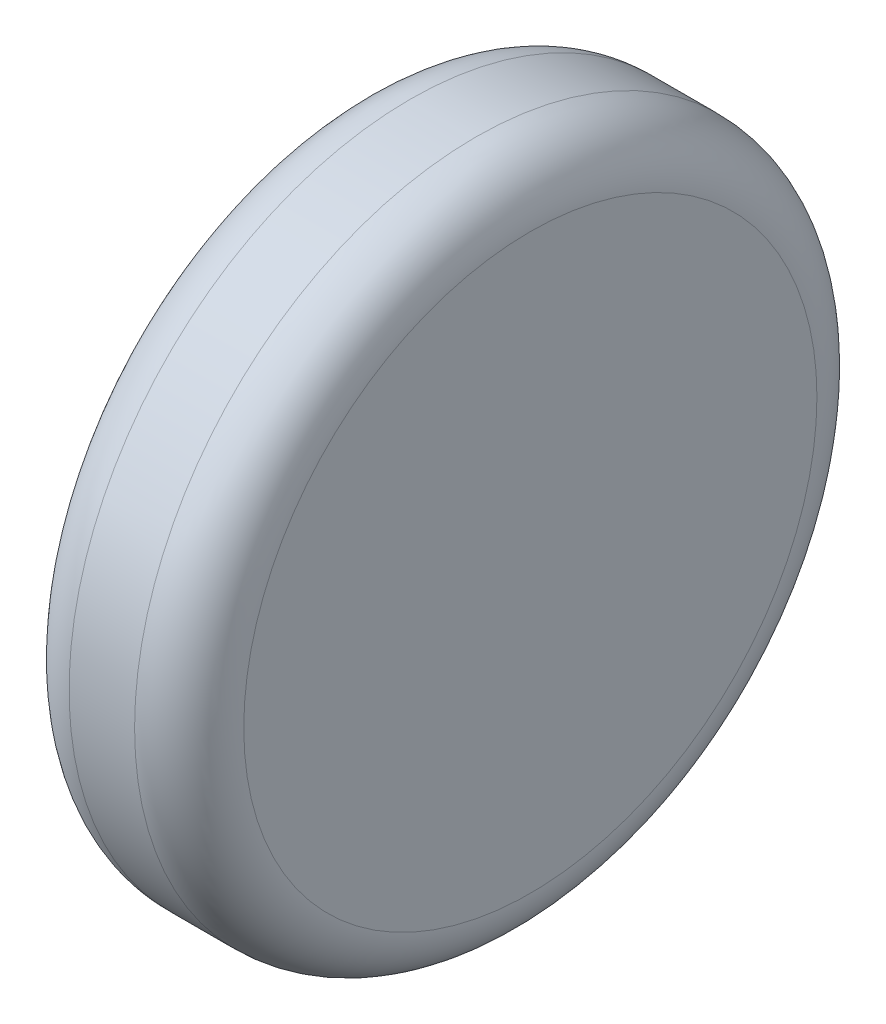
ISO-10303-21;
HEADER;
FILE_DESCRIPTION(('STEP AP214'),'2;1');
FILE_NAME('part.step','',(''),(''),'','','');
FILE_SCHEMA(('AUTOMOTIVE_DESIGN { 1 0 10303 214 1 1 1 1 }'));
ENDSEC;
DATA;
#1=APPLICATION_CONTEXT('core data for automotive mechanical design processes');
#2=APPLICATION_PROTOCOL_DEFINITION('international standard','automotive_design',2000,#1);
#3=PRODUCT_CONTEXT('',#1,'mechanical');
#4=PRODUCT('Part','Part','',(#3));
#5=PRODUCT_RELATED_PRODUCT_CATEGORY('part','',(#4));
#6=PRODUCT_DEFINITION_FORMATION('','',#4);
#7=PRODUCT_DEFINITION_CONTEXT('part definition',#1,'design');
#8=PRODUCT_DEFINITION('design','',#6,#7);
#9=PRODUCT_DEFINITION_SHAPE('','',#8);
#10=(LENGTH_UNIT() NAMED_UNIT(*) SI_UNIT(.MILLI.,.METRE.));
#11=(NAMED_UNIT(*) PLANE_ANGLE_UNIT() SI_UNIT($,.RADIAN.));
#12=(NAMED_UNIT(*) SI_UNIT($,.STERADIAN.) SOLID_ANGLE_UNIT());
#13=UNCERTAINTY_MEASURE_WITH_UNIT(LENGTH_MEASURE(1.E-05),#10,'distance_accuracy_value','');
#14=(GEOMETRIC_REPRESENTATION_CONTEXT(3) GLOBAL_UNCERTAINTY_ASSIGNED_CONTEXT((#13)) GLOBAL_UNIT_ASSIGNED_CONTEXT((#10,
#11,#12)) REPRESENTATION_CONTEXT('',''));
#15=CARTESIAN_POINT('',(0.,0.,0.));
#16=DIRECTION('',(0.,0.,1.));
#17=DIRECTION('',(1.,0.,0.));
#18=AXIS2_PLACEMENT_3D('',#15,#16,#17);
#19=CARTESIAN_POINT('',(1.07963571469062,-0.332340218761648,0.1012));
#20=DIRECTION('',(1.,0.,0.));
#21=DIRECTION('',(0.,1.,0.));
#22=AXIS2_PLACEMENT_3D('',#19,#20,#21);
#23=PLANE('',#22);
#24=CARTESIAN_POINT('',(1.07963571469062,-0.332340218761648,0.1012));
#25=DIRECTION('',(1.,0.,0.));
#26=DIRECTION('',(0.,0.,-1.));
#27=AXIS2_PLACEMENT_3D('',#24,#25,#26);
#28=CIRCLE('',#27,0.0262499999999999);
#29=CARTESIAN_POINT('',(1.07963571469062,-0.332340218761648,0.0749500000000001));
#30=VERTEX_POINT('',#29);
#31=CARTESIAN_POINT('',(1.07963571469062,-0.306090218761648,0.1012));
#32=VERTEX_POINT('',#31);
#33=EDGE_CURVE('E55',#30,#32,#28,.T.);
#34=ORIENTED_EDGE('',*,*,#33,.F.);
#35=CARTESIAN_POINT('',(1.07963571469062,-0.332340218761648,0.1012));
#36=DIRECTION('',(1.,0.,0.));
#37=DIRECTION('',(0.,0.,1.));
#38=AXIS2_PLACEMENT_3D('',#35,#36,#37);
#39=CIRCLE('',#38,0.02625);
#40=CARTESIAN_POINT('',(1.07963571469062,-0.332340218761648,0.12745));
#41=VERTEX_POINT('',#40);
#42=EDGE_CURVE('E49',#41,#30,#39,.T.);
#43=ORIENTED_EDGE('',*,*,#42,.F.);
#44=CARTESIAN_POINT('',(1.07963571469062,-0.332340218761648,0.1012));
#45=DIRECTION('',(1.,0.,0.));
#46=DIRECTION('',(0.,1.,0.));
#47=AXIS2_PLACEMENT_3D('',#44,#45,#46);
#48=CIRCLE('',#47,0.02625);
#49=EDGE_CURVE('E53',#32,#41,#48,.T.);
#50=ORIENTED_EDGE('',*,*,#49,.F.);
#51=EDGE_LOOP('',(#34,#43,#50));
#52=FACE_BOUND('',#51,.T.);
#53=ADVANCED_FACE('F17',(#52),#23,.F.);
#54=CARTESIAN_POINT('',(1.08463571469062,-0.332340218761648,0.1012));
#55=DIRECTION('',(1.,0.,0.));
#56=DIRECTION('',(0.,0.,1.));
#57=AXIS2_PLACEMENT_3D('',#54,#55,#56);
#58=TOROIDAL_SURFACE('',#57,0.02625,0.005);
#59=CARTESIAN_POINT('',(1.08463571469062,-0.332340218761648,0.1012));
#60=DIRECTION('',(1.,0.,0.));
#61=DIRECTION('',(0.,1.,0.));
#62=AXIS2_PLACEMENT_3D('',#59,#60,#61);
#63=CIRCLE('',#62,0.03125);
#64=CARTESIAN_POINT('',(1.08463571469062,-0.301090218761648,0.1012));
#65=VERTEX_POINT('',#64);
#66=EDGE_CURVE('E62',#65,#65,#63,.T.);
#67=ORIENTED_EDGE('',*,*,#66,.F.);
#68=EDGE_LOOP('',(#67));
#69=FACE_BOUND('',#68,.T.);
#70=ORIENTED_EDGE('',*,*,#33,.T.);
#71=ORIENTED_EDGE('',*,*,#49,.T.);
#72=ORIENTED_EDGE('',*,*,#42,.T.);
#73=EDGE_LOOP('',(#70,#71,#72));
#74=FACE_BOUND('',#73,.T.);
#75=ADVANCED_FACE('F60',(#69,#74),#58,.T.);
#76=CARTESIAN_POINT('',(1.09563571469062,-0.332340218761648,0.1012));
#77=DIRECTION('',(1.,0.,0.));
#78=DIRECTION('',(0.,1.,0.));
#79=AXIS2_PLACEMENT_3D('',#76,#77,#78);
#80=CYLINDRICAL_SURFACE('',#79,0.03125);
#81=CARTESIAN_POINT('',(1.09063571469062,-0.332340218761648,0.1012));
#82=DIRECTION('',(1.,0.,0.));
#83=DIRECTION('',(0.,0.,1.));
#84=AXIS2_PLACEMENT_3D('',#81,#82,#83);
#85=CIRCLE('',#84,0.03125);
#86=CARTESIAN_POINT('',(1.09063571469062,-0.332340218761648,0.13245));
#87=VERTEX_POINT('',#86);
#88=EDGE_CURVE('E86',#87,#87,#85,.T.);
#89=ORIENTED_EDGE('',*,*,#88,.F.);
#90=EDGE_LOOP('',(#89));
#91=FACE_BOUND('',#90,.T.);
#92=ORIENTED_EDGE('',*,*,#66,.T.);
#93=EDGE_LOOP('',(#92));
#94=FACE_BOUND('',#93,.T.);
#95=ADVANCED_FACE('F79',(#91,#94),#80,.T.);
#96=CARTESIAN_POINT('',(1.09063571469062,-0.332340218761648,0.1012));
#97=DIRECTION('',(1.,0.,0.));
#98=DIRECTION('',(0.,0.,1.));
#99=AXIS2_PLACEMENT_3D('',#96,#97,#98);
#100=TOROIDAL_SURFACE('',#99,0.02625,0.005);
#101=ORIENTED_EDGE('',*,*,#88,.T.);
#102=EDGE_LOOP('',(#101));
#103=FACE_BOUND('',#102,.T.);
#104=CARTESIAN_POINT('',(1.09563571469062,-0.332340218761648,0.1012));
#105=DIRECTION('',(-1.,0.,0.));
#106=DIRECTION('',(0.,0.,-1.));
#107=AXIS2_PLACEMENT_3D('',#104,#105,#106);
#108=CIRCLE('',#107,0.0262499999999999);
#109=CARTESIAN_POINT('',(1.09563571469062,-0.332340218761648,0.12745));
#110=VERTEX_POINT('',#109);
#111=CARTESIAN_POINT('',(1.09563571469062,-0.332340218761648,0.0749500000000001));
#112=VERTEX_POINT('',#111);
#113=EDGE_CURVE('E11',#110,#112,#108,.F.);
#114=ORIENTED_EDGE('',*,*,#113,.F.);
#115=CARTESIAN_POINT('',(1.09563571469062,-0.332340218761648,0.1012));
#116=DIRECTION('',(-1.,0.,0.));
#117=DIRECTION('',(0.,0.,1.));
#118=AXIS2_PLACEMENT_3D('',#115,#116,#117);
#119=CIRCLE('',#118,0.02625);
#120=CARTESIAN_POINT('',(1.09563571469062,-0.306090218761648,0.1012));
#121=VERTEX_POINT('',#120);
#122=EDGE_CURVE('E28',#121,#110,#119,.F.);
#123=ORIENTED_EDGE('',*,*,#122,.F.);
#124=CARTESIAN_POINT('',(1.09563571469062,-0.332340218761648,0.1012));
#125=DIRECTION('',(-1.,0.,0.));
#126=DIRECTION('',(0.,1.,0.));
#127=AXIS2_PLACEMENT_3D('',#124,#125,#126);
#128=CIRCLE('',#127,0.02625);
#129=EDGE_CURVE('E92',#112,#121,#128,.F.);
#130=ORIENTED_EDGE('',*,*,#129,.F.);
#131=EDGE_LOOP('',(#114,#123,#130));
#132=FACE_BOUND('',#131,.T.);
#133=ADVANCED_FACE('F117',(#103,#132),#100,.T.);
#134=CARTESIAN_POINT('',(1.09563571469062,-0.332340218761648,0.1012));
#135=DIRECTION('',(1.,0.,0.));
#136=DIRECTION('',(0.,1.,0.));
#137=AXIS2_PLACEMENT_3D('',#134,#135,#136);
#138=PLANE('',#137);
#139=ORIENTED_EDGE('',*,*,#122,.T.);
#140=ORIENTED_EDGE('',*,*,#113,.T.);
#141=ORIENTED_EDGE('',*,*,#129,.T.);
#142=EDGE_LOOP('',(#139,#140,#141));
#143=FACE_BOUND('',#142,.T.);
#144=ADVANCED_FACE('F99',(#143),#138,.T.);
#145=CLOSED_SHELL('',(#53,#75,#95,#133,#144));
#146=MANIFOLD_SOLID_BREP('B1',#145);
#147=ADVANCED_BREP_SHAPE_REPRESENTATION('',(#18,#146),#14);
#148=SHAPE_DEFINITION_REPRESENTATION(#9,#147);
ENDSEC;
END-ISO-10303-21;
